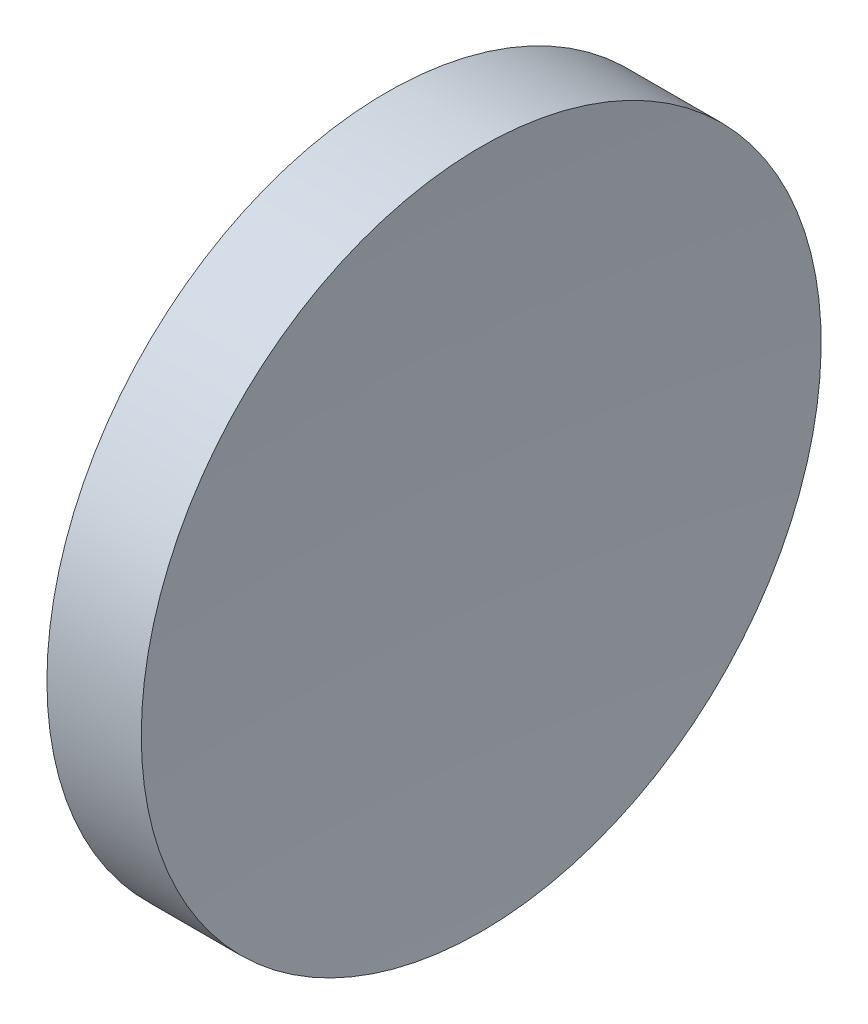
ISO-10303-21;
HEADER;
FILE_DESCRIPTION(('STEP AP214'),'2;1');
FILE_NAME('part.step','',(''),(''),'','','');
FILE_SCHEMA(('AUTOMOTIVE_DESIGN { 1 0 10303 214 1 1 1 1 }'));
ENDSEC;
DATA;
#1=APPLICATION_CONTEXT('core data for automotive mechanical design processes');
#2=APPLICATION_PROTOCOL_DEFINITION('international standard','automotive_design',2000,#1);
#3=PRODUCT_CONTEXT('',#1,'mechanical');
#4=PRODUCT('Part','Part','',(#3));
#5=PRODUCT_RELATED_PRODUCT_CATEGORY('part','',(#4));
#6=PRODUCT_DEFINITION_FORMATION('','',#4);
#7=PRODUCT_DEFINITION_CONTEXT('part definition',#1,'design');
#8=PRODUCT_DEFINITION('design','',#6,#7);
#9=PRODUCT_DEFINITION_SHAPE('','',#8);
#10=(LENGTH_UNIT() NAMED_UNIT(*) SI_UNIT(.MILLI.,.METRE.));
#11=(NAMED_UNIT(*) PLANE_ANGLE_UNIT() SI_UNIT($,.RADIAN.));
#12=(NAMED_UNIT(*) SI_UNIT($,.STERADIAN.) SOLID_ANGLE_UNIT());
#13=UNCERTAINTY_MEASURE_WITH_UNIT(LENGTH_MEASURE(1.E-05),#10,'distance_accuracy_value','');
#14=(GEOMETRIC_REPRESENTATION_CONTEXT(3) GLOBAL_UNCERTAINTY_ASSIGNED_CONTEXT((#13)) GLOBAL_UNIT_ASSIGNED_CONTEXT((#10,
#11,#12)) REPRESENTATION_CONTEXT('',''));
#15=CARTESIAN_POINT('',(0.,0.,0.));
#16=DIRECTION('',(0.,0.,1.));
#17=DIRECTION('',(1.,0.,0.));
#18=AXIS2_PLACEMENT_3D('',#15,#16,#17);
#19=CARTESIAN_POINT('',(739.199612454559,138.756042246745,0.));
#20=DIRECTION('',(-1.,0.,0.));
#21=DIRECTION('',(0.,-1.,0.));
#22=AXIS2_PLACEMENT_3D('',#19,#20,#21);
#23=SPHERICAL_SURFACE('',#22,500.);
#24=CARTESIAN_POINT('',(240.607845575081,138.756042246745,0.));
#25=DIRECTION('',(-1.,0.,0.));
#26=DIRECTION('',(0.,0.,1.));
#27=AXIS2_PLACEMENT_3D('',#24,#25,#26);
#28=CIRCLE('',#27,37.5);
#29=CARTESIAN_POINT('',(240.607845575081,138.756042246745,37.5));
#30=VERTEX_POINT('',#29);
#31=EDGE_CURVE('E10',#30,#30,#28,.T.);
#32=ORIENTED_EDGE('',*,*,#31,.F.);
#33=EDGE_LOOP('',(#32));
#34=FACE_BOUND('',#33,.T.);
#35=ADVANCED_FACE('F35',(#34),#23,.F.);
#36=CARTESIAN_POINT('',(217.97028600433,138.756042246745,0.));
#37=DIRECTION('',(-1.,0.,0.));
#38=DIRECTION('',(0.,0.,1.));
#39=AXIS2_PLACEMENT_3D('',#36,#37,#38);
#40=CYLINDRICAL_SURFACE('',#39,37.5);
#41=CARTESIAN_POINT('',(230.199611905266,138.756042246745,0.));
#42=DIRECTION('',(-1.,0.,0.));
#43=DIRECTION('',(0.,0.,1.));
#44=AXIS2_PLACEMENT_3D('',#41,#42,#43);
#45=CIRCLE('',#44,37.5);
#46=CARTESIAN_POINT('',(230.199611905266,138.756042246745,37.5));
#47=VERTEX_POINT('',#46);
#48=EDGE_CURVE('E41',#47,#47,#45,.T.);
#49=ORIENTED_EDGE('',*,*,#48,.F.);
#50=EDGE_LOOP('',(#49));
#51=FACE_BOUND('',#50,.T.);
#52=ORIENTED_EDGE('',*,*,#31,.T.);
#53=EDGE_LOOP('',(#52));
#54=FACE_BOUND('',#53,.T.);
#55=ADVANCED_FACE('F49',(#51,#54),#40,.T.);
#56=CARTESIAN_POINT('',(230.199611905266,138.756042246745,0.));
#57=DIRECTION('',(1.,0.,0.));
#58=DIRECTION('',(0.,0.,-1.));
#59=AXIS2_PLACEMENT_3D('',#56,#57,#58);
#60=PLANE('',#59);
#61=ORIENTED_EDGE('',*,*,#48,.T.);
#62=EDGE_LOOP('',(#61));
#63=FACE_BOUND('',#62,.T.);
#64=ADVANCED_FACE('F47',(#63),#60,.F.);
#65=CLOSED_SHELL('',(#35,#55,#64));
#66=MANIFOLD_SOLID_BREP('B2',#65);
#67=ADVANCED_BREP_SHAPE_REPRESENTATION('',(#18,#66),#14);
#68=SHAPE_DEFINITION_REPRESENTATION(#9,#67);
ENDSEC;
END-ISO-10303-21;
